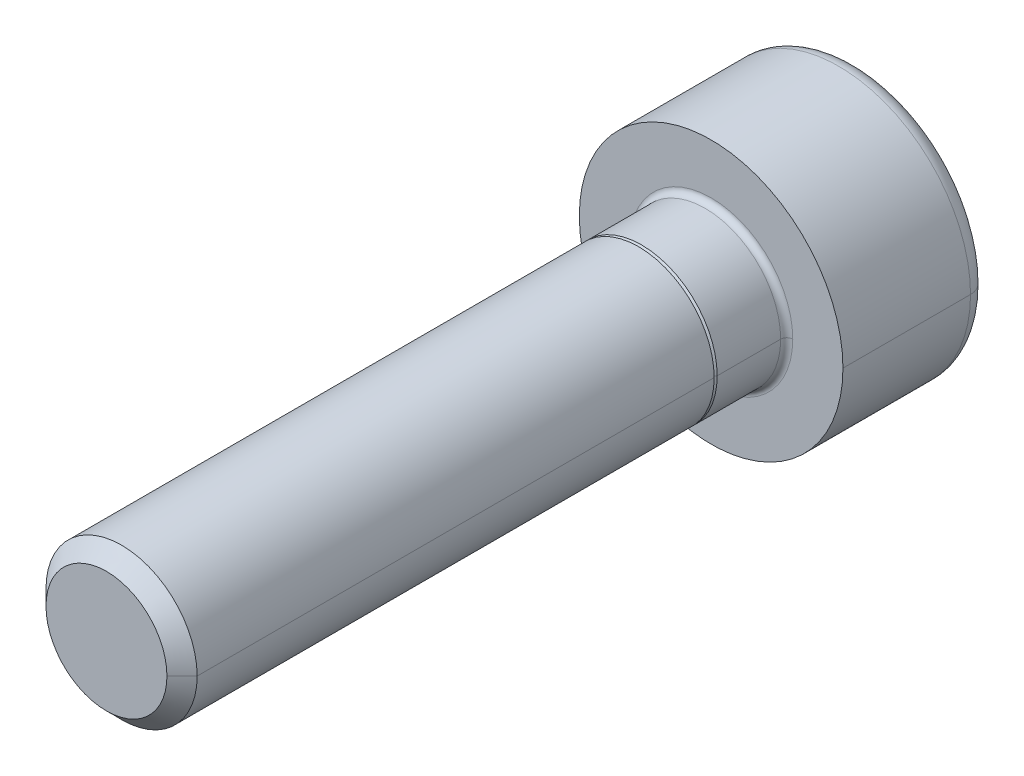
ISO-10303-21;
HEADER;
FILE_DESCRIPTION(('STEP AP214'),'2;1');
FILE_NAME('part.step','',(''),(''),'','','');
FILE_SCHEMA(('AUTOMOTIVE_DESIGN { 1 0 10303 214 1 1 1 1 }'));
ENDSEC;
DATA;
#1=APPLICATION_CONTEXT('core data for automotive mechanical design processes');
#2=APPLICATION_PROTOCOL_DEFINITION('international standard','automotive_design',2000,#1);
#3=PRODUCT_CONTEXT('',#1,'mechanical');
#4=PRODUCT('Part','Part','',(#3));
#5=PRODUCT_RELATED_PRODUCT_CATEGORY('part','',(#4));
#6=PRODUCT_DEFINITION_FORMATION('','',#4);
#7=PRODUCT_DEFINITION_CONTEXT('part definition',#1,'design');
#8=PRODUCT_DEFINITION('design','',#6,#7);
#9=PRODUCT_DEFINITION_SHAPE('','',#8);
#10=(LENGTH_UNIT() NAMED_UNIT(*) SI_UNIT(.MILLI.,.METRE.));
#11=(NAMED_UNIT(*) PLANE_ANGLE_UNIT() SI_UNIT($,.RADIAN.));
#12=(NAMED_UNIT(*) SI_UNIT($,.STERADIAN.) SOLID_ANGLE_UNIT());
#13=UNCERTAINTY_MEASURE_WITH_UNIT(LENGTH_MEASURE(1.E-05),#10,'distance_accuracy_value','');
#14=(GEOMETRIC_REPRESENTATION_CONTEXT(3) GLOBAL_UNCERTAINTY_ASSIGNED_CONTEXT((#13)) GLOBAL_UNIT_ASSIGNED_CONTEXT((#10,
#11,#12)) REPRESENTATION_CONTEXT('',''));
#15=CARTESIAN_POINT('',(0.,0.,0.));
#16=DIRECTION('',(0.,0.,1.));
#17=DIRECTION('',(1.,0.,0.));
#18=AXIS2_PLACEMENT_3D('',#15,#16,#17);
#19=CARTESIAN_POINT('',(0.,0.,-4.22));
#20=DIRECTION('',(0.,0.,1.));
#21=DIRECTION('',(1.,0.,0.));
#22=AXIS2_PLACEMENT_3D('',#19,#20,#21);
#23=TOROIDAL_SURFACE('',#22,3.76,0.6);
#24=CARTESIAN_POINT('',(-3.76,0.,-4.22));
#25=DIRECTION('',(0.,1.,0.));
#26=DIRECTION('',(-1.,0.,0.));
#27=AXIS2_PLACEMENT_3D('',#24,#25,#26);
#28=CIRCLE('',#27,0.6);
#29=CARTESIAN_POINT('',(-3.76,0.,-4.82));
#30=VERTEX_POINT('',#29);
#31=CARTESIAN_POINT('',(-4.36,0.,-4.22));
#32=VERTEX_POINT('',#31);
#33=EDGE_CURVE('E377',#30,#32,#28,.T.);
#34=ORIENTED_EDGE('',*,*,#33,.F.);
#35=CARTESIAN_POINT('',(0.,0.,-4.82));
#36=DIRECTION('',(0.,0.,-1.));
#37=DIRECTION('',(1.,0.,0.));
#38=AXIS2_PLACEMENT_3D('',#35,#36,#37);
#39=CIRCLE('',#38,3.76);
#40=CARTESIAN_POINT('',(3.76,0.,-4.82));
#41=VERTEX_POINT('',#40);
#42=EDGE_CURVE('E274',#41,#30,#39,.T.);
#43=ORIENTED_EDGE('',*,*,#42,.F.);
#44=CARTESIAN_POINT('',(3.76,0.,-4.22));
#45=DIRECTION('',(0.,-1.,0.));
#46=DIRECTION('',(0.,0.,-1.));
#47=AXIS2_PLACEMENT_3D('',#44,#45,#46);
#48=CIRCLE('',#47,0.6);
#49=CARTESIAN_POINT('',(4.36,0.,-4.22));
#50=VERTEX_POINT('',#49);
#51=EDGE_CURVE('E390',#41,#50,#48,.T.);
#52=ORIENTED_EDGE('',*,*,#51,.T.);
#53=CARTESIAN_POINT('',(0.,0.,-4.22));
#54=DIRECTION('',(0.,0.,1.));
#55=DIRECTION('',(1.,0.,0.));
#56=AXIS2_PLACEMENT_3D('',#53,#54,#55);
#57=CIRCLE('',#56,4.36);
#58=EDGE_CURVE('E268',#32,#50,#57,.T.);
#59=ORIENTED_EDGE('',*,*,#58,.F.);
#60=EDGE_LOOP('',(#34,#43,#52,#59));
#61=FACE_BOUND('',#60,.T.);
#62=ADVANCED_FACE('F17',(#61),#23,.T.);
#63=CARTESIAN_POINT('',(0.,0.,0.2));
#64=DIRECTION('',(0.,0.,1.));
#65=DIRECTION('',(1.,0.,0.));
#66=AXIS2_PLACEMENT_3D('',#63,#64,#65);
#67=TOROIDAL_SURFACE('',#66,2.7,0.2);
#68=CARTESIAN_POINT('',(-2.7,0.,0.2));
#69=DIRECTION('',(0.,1.,0.));
#70=DIRECTION('',(-1.,0.,0.));
#71=AXIS2_PLACEMENT_3D('',#68,#69,#70);
#72=CIRCLE('',#71,0.2);
#73=CARTESIAN_POINT('',(-2.5,0.,0.2));
#74=VERTEX_POINT('',#73);
#75=CARTESIAN_POINT('',(-2.7,0.,0.));
#76=VERTEX_POINT('',#75);
#77=EDGE_CURVE('E196',#74,#76,#72,.T.);
#78=ORIENTED_EDGE('',*,*,#77,.F.);
#79=CARTESIAN_POINT('',(0.,0.,0.2));
#80=DIRECTION('',(0.,0.,1.));
#81=DIRECTION('',(1.,0.,0.));
#82=AXIS2_PLACEMENT_3D('',#79,#80,#81);
#83=CIRCLE('',#82,2.5);
#84=CARTESIAN_POINT('',(2.5,0.,0.2));
#85=VERTEX_POINT('',#84);
#86=EDGE_CURVE('E187',#85,#74,#83,.T.);
#87=ORIENTED_EDGE('',*,*,#86,.F.);
#88=CARTESIAN_POINT('',(2.7,0.,0.2));
#89=DIRECTION('',(0.,-1.,0.));
#90=DIRECTION('',(0.,0.,-1.));
#91=AXIS2_PLACEMENT_3D('',#88,#89,#90);
#92=CIRCLE('',#91,0.2);
#93=CARTESIAN_POINT('',(2.7,0.,0.));
#94=VERTEX_POINT('',#93);
#95=EDGE_CURVE('E184',#85,#94,#92,.T.);
#96=ORIENTED_EDGE('',*,*,#95,.T.);
#97=CARTESIAN_POINT('',(0.,0.,0.));
#98=DIRECTION('',(0.,0.,-1.));
#99=DIRECTION('',(1.,0.,0.));
#100=AXIS2_PLACEMENT_3D('',#97,#98,#99);
#101=CIRCLE('',#100,2.7);
#102=EDGE_CURVE('E170',#76,#94,#101,.T.);
#103=ORIENTED_EDGE('',*,*,#102,.F.);
#104=EDGE_LOOP('',(#78,#87,#96,#103));
#105=FACE_BOUND('',#104,.T.);
#106=ADVANCED_FACE('F185',(#105),#67,.F.);
#107=CARTESIAN_POINT('',(0.,0.,20.));
#108=DIRECTION('',(0.,0.,-1.));
#109=DIRECTION('',(-1.,0.,0.));
#110=AXIS2_PLACEMENT_3D('',#107,#108,#109);
#111=CONICAL_SURFACE('',#110,2.,0.785398163397446);
#112=DIRECTION('',(0.707106781186546,0.,-0.707106781186549));
#113=VECTOR('',#112,1.);
#114=CARTESIAN_POINT('',(2.,0.,20.));
#115=LINE('',#114,#113);
#116=CARTESIAN_POINT('',(2.,0.,20.));
#117=VERTEX_POINT('',#116);
#118=CARTESIAN_POINT('',(2.5,0.,19.5));
#119=VERTEX_POINT('',#118);
#120=EDGE_CURVE('E211',#117,#119,#115,.T.);
#121=ORIENTED_EDGE('',*,*,#120,.F.);
#122=CARTESIAN_POINT('',(0.,0.,20.));
#123=DIRECTION('',(0.,0.,1.));
#124=DIRECTION('',(1.,0.,0.));
#125=AXIS2_PLACEMENT_3D('',#122,#123,#124);
#126=CIRCLE('',#125,2.);
#127=CARTESIAN_POINT('',(-2.,0.,20.));
#128=VERTEX_POINT('',#127);
#129=EDGE_CURVE('E11',#128,#117,#126,.T.);
#130=ORIENTED_EDGE('',*,*,#129,.F.);
#131=DIRECTION('',(-0.707106781186546,0.,-0.707106781186549));
#132=VECTOR('',#131,1.);
#133=CARTESIAN_POINT('',(-2.,0.,20.));
#134=LINE('',#133,#132);
#135=CARTESIAN_POINT('',(-2.5,0.,19.5));
#136=VERTEX_POINT('',#135);
#137=EDGE_CURVE('E225',#128,#136,#134,.T.);
#138=ORIENTED_EDGE('',*,*,#137,.T.);
#139=CARTESIAN_POINT('',(0.,0.,19.5));
#140=DIRECTION('',(0.,0.,-1.));
#141=DIRECTION('',(1.,0.,0.));
#142=AXIS2_PLACEMENT_3D('',#139,#140,#141);
#143=CIRCLE('',#142,2.5);
#144=EDGE_CURVE('E20',#119,#136,#143,.T.);
#145=ORIENTED_EDGE('',*,*,#144,.F.);
#146=EDGE_LOOP('',(#121,#130,#138,#145));
#147=FACE_BOUND('',#146,.T.);
#148=ADVANCED_FACE('F353',(#147),#111,.T.);
#149=CARTESIAN_POINT('',(0.,0.,2.4));
#150=DIRECTION('',(0.,0.,1.));
#151=DIRECTION('',(1.,0.,0.));
#152=AXIS2_PLACEMENT_3D('',#149,#150,#151);
#153=PLANE('',#152);
#154=CARTESIAN_POINT('',(0.,0.,2.4));
#155=DIRECTION('',(0.,0.,1.));
#156=DIRECTION('',(1.,0.,0.));
#157=AXIS2_PLACEMENT_3D('',#154,#155,#156);
#158=CIRCLE('',#157,2.4);
#159=CARTESIAN_POINT('',(-2.4,0.,2.4));
#160=VERTEX_POINT('',#159);
#161=CARTESIAN_POINT('',(2.4,0.,2.4));
#162=VERTEX_POINT('',#161);
#163=EDGE_CURVE('E332',#160,#162,#158,.T.);
#164=ORIENTED_EDGE('',*,*,#163,.T.);
#165=CARTESIAN_POINT('',(0.,0.,2.4));
#166=DIRECTION('',(0.,0.,1.));
#167=DIRECTION('',(1.,0.,0.));
#168=AXIS2_PLACEMENT_3D('',#165,#166,#167);
#169=CIRCLE('',#168,2.4);
#170=EDGE_CURVE('E212',#162,#160,#169,.T.);
#171=ORIENTED_EDGE('',*,*,#170,.T.);
#172=EDGE_LOOP('',(#164,#171));
#173=FACE_BOUND('',#172,.T.);
#174=CARTESIAN_POINT('',(0.,0.,2.4));
#175=DIRECTION('',(0.,0.,1.));
#176=DIRECTION('',(1.,0.,0.));
#177=AXIS2_PLACEMENT_3D('',#174,#175,#176);
#178=CIRCLE('',#177,2.5);
#179=CARTESIAN_POINT('',(-2.5,0.,2.4));
#180=VERTEX_POINT('',#179);
#181=CARTESIAN_POINT('',(2.5,0.,2.4));
#182=VERTEX_POINT('',#181);
#183=EDGE_CURVE('E26',#180,#182,#178,.T.);
#184=ORIENTED_EDGE('',*,*,#183,.F.);
#185=CARTESIAN_POINT('',(0.,0.,2.4));
#186=DIRECTION('',(0.,0.,1.));
#187=DIRECTION('',(1.,0.,0.));
#188=AXIS2_PLACEMENT_3D('',#185,#186,#187);
#189=CIRCLE('',#188,2.5);
#190=EDGE_CURVE('E230',#182,#180,#189,.T.);
#191=ORIENTED_EDGE('',*,*,#190,.F.);
#192=EDGE_LOOP('',(#184,#191));
#193=FACE_BOUND('',#192,.T.);
#194=ADVANCED_FACE('F360',(#173,#193),#153,.F.);
#195=CARTESIAN_POINT('',(0.,0.,20.));
#196=DIRECTION('',(0.,0.,1.));
#197=DIRECTION('',(1.,0.,0.));
#198=AXIS2_PLACEMENT_3D('',#195,#196,#197);
#199=PLANE('',#198);
#200=ORIENTED_EDGE('',*,*,#129,.T.);
#201=CARTESIAN_POINT('',(0.,0.,20.));
#202=DIRECTION('',(0.,0.,1.));
#203=DIRECTION('',(1.,0.,0.));
#204=AXIS2_PLACEMENT_3D('',#201,#202,#203);
#205=CIRCLE('',#204,2.);
#206=EDGE_CURVE('E193',#117,#128,#205,.T.);
#207=ORIENTED_EDGE('',*,*,#206,.T.);
#208=EDGE_LOOP('',(#200,#207));
#209=FACE_BOUND('',#208,.T.);
#210=ADVANCED_FACE('F358',(#209),#199,.T.);
#211=CARTESIAN_POINT('',(0.,0.,20.));
#212=DIRECTION('',(0.,0.,-1.));
#213=DIRECTION('',(-1.,0.,0.));
#214=AXIS2_PLACEMENT_3D('',#211,#212,#213);
#215=CYLINDRICAL_SURFACE('',#214,2.5);
#216=DIRECTION('',(0.,0.,-1.));
#217=VECTOR('',#216,1.);
#218=CARTESIAN_POINT('',(2.5,0.,20.));
#219=LINE('',#218,#217);
#220=EDGE_CURVE('E226',#119,#182,#219,.T.);
#221=ORIENTED_EDGE('',*,*,#220,.F.);
#222=ORIENTED_EDGE('',*,*,#144,.T.);
#223=DIRECTION('',(0.,0.,-1.));
#224=VECTOR('',#223,1.);
#225=CARTESIAN_POINT('',(-2.5,0.,20.));
#226=LINE('',#225,#224);
#227=EDGE_CURVE('E217',#136,#180,#226,.T.);
#228=ORIENTED_EDGE('',*,*,#227,.T.);
#229=ORIENTED_EDGE('',*,*,#183,.T.);
#230=EDGE_LOOP('',(#221,#222,#228,#229));
#231=FACE_BOUND('',#230,.T.);
#232=ADVANCED_FACE('F344',(#231),#215,.T.);
#233=CARTESIAN_POINT('',(0.,0.,2.4));
#234=DIRECTION('',(0.,0.,-1.));
#235=DIRECTION('',(-1.,0.,0.));
#236=AXIS2_PLACEMENT_3D('',#233,#234,#235);
#237=CONICAL_SURFACE('',#236,2.4,0.785398163397442);
#238=DIRECTION('',(0.707106781186543,0.,-0.707106781186552));
#239=VECTOR('',#238,1.);
#240=CARTESIAN_POINT('',(2.4,0.,2.4));
#241=LINE('',#240,#239);
#242=CARTESIAN_POINT('',(2.5,0.,2.3));
#243=VERTEX_POINT('',#242);
#244=EDGE_CURVE('E216',#162,#243,#241,.T.);
#245=ORIENTED_EDGE('',*,*,#244,.F.);
#246=ORIENTED_EDGE('',*,*,#163,.F.);
#247=DIRECTION('',(-0.707106781186543,0.,-0.707106781186552));
#248=VECTOR('',#247,1.);
#249=CARTESIAN_POINT('',(-2.4,0.,2.4));
#250=LINE('',#249,#248);
#251=CARTESIAN_POINT('',(-2.5,0.,2.3));
#252=VERTEX_POINT('',#251);
#253=EDGE_CURVE('E244',#160,#252,#250,.T.);
#254=ORIENTED_EDGE('',*,*,#253,.T.);
#255=CARTESIAN_POINT('',(0.,0.,2.3));
#256=DIRECTION('',(0.,0.,-1.));
#257=DIRECTION('',(1.,0.,0.));
#258=AXIS2_PLACEMENT_3D('',#255,#256,#257);
#259=CIRCLE('',#258,2.5);
#260=EDGE_CURVE('E330',#243,#252,#259,.T.);
#261=ORIENTED_EDGE('',*,*,#260,.F.);
#262=EDGE_LOOP('',(#245,#246,#254,#261));
#263=FACE_BOUND('',#262,.T.);
#264=ADVANCED_FACE('F367',(#263),#237,.T.);
#265=CARTESIAN_POINT('',(0.,0.,2.4));
#266=DIRECTION('',(0.,0.,-1.));
#267=DIRECTION('',(-1.,0.,0.));
#268=AXIS2_PLACEMENT_3D('',#265,#266,#267);
#269=CYLINDRICAL_SURFACE('',#268,2.5);
#270=DIRECTION('',(0.,0.,-1.));
#271=VECTOR('',#270,1.);
#272=CARTESIAN_POINT('',(2.5,0.,2.4));
#273=LINE('',#272,#271);
#274=EDGE_CURVE('E248',#243,#85,#273,.T.);
#275=ORIENTED_EDGE('',*,*,#274,.F.);
#276=ORIENTED_EDGE('',*,*,#260,.T.);
#277=DIRECTION('',(0.,0.,-1.));
#278=VECTOR('',#277,1.);
#279=CARTESIAN_POINT('',(-2.5,0.,2.4));
#280=LINE('',#279,#278);
#281=EDGE_CURVE('E253',#252,#74,#280,.T.);
#282=ORIENTED_EDGE('',*,*,#281,.T.);
#283=CARTESIAN_POINT('',(0.,0.,0.2));
#284=DIRECTION('',(0.,0.,1.));
#285=DIRECTION('',(1.,0.,0.));
#286=AXIS2_PLACEMENT_3D('',#283,#284,#285);
#287=CIRCLE('',#286,2.5);
#288=EDGE_CURVE('E203',#74,#85,#287,.T.);
#289=ORIENTED_EDGE('',*,*,#288,.T.);
#290=EDGE_LOOP('',(#275,#276,#282,#289));
#291=FACE_BOUND('',#290,.T.);
#292=ADVANCED_FACE('F480',(#291),#269,.T.);
#293=CARTESIAN_POINT('',(0.,0.,-2.32));
#294=DIRECTION('',(0.,0.,-1.));
#295=DIRECTION('',(0.,-1.,0.));
#296=AXIS2_PLACEMENT_3D('',#293,#294,#295);
#297=PLANE('',#296);
#298=DIRECTION('',(-0.5,-0.866025403784439,0.));
#299=VECTOR('',#298,1.);
#300=CARTESIAN_POINT('',(2.64426423288849,0.,-2.32));
#301=LINE('',#300,#299);
#302=CARTESIAN_POINT('',(2.64426423288849,0.,-2.32));
#303=VERTEX_POINT('',#302);
#304=CARTESIAN_POINT('',(1.32213211644424,-2.29,-2.32));
#305=VERTEX_POINT('',#304);
#306=EDGE_CURVE('E233',#303,#305,#301,.T.);
#307=ORIENTED_EDGE('',*,*,#306,.T.);
#308=DIRECTION('',(-1.,0.,0.));
#309=VECTOR('',#308,1.);
#310=CARTESIAN_POINT('',(1.32213211644424,-2.29,-2.32));
#311=LINE('',#310,#309);
#312=CARTESIAN_POINT('',(-1.32213211644424,-2.29,-2.32));
#313=VERTEX_POINT('',#312);
#314=EDGE_CURVE('E40',#305,#313,#311,.T.);
#315=ORIENTED_EDGE('',*,*,#314,.T.);
#316=DIRECTION('',(-0.5,0.866025403784439,0.));
#317=VECTOR('',#316,1.);
#318=CARTESIAN_POINT('',(-1.32213211644424,-2.29,-2.32));
#319=LINE('',#318,#317);
#320=CARTESIAN_POINT('',(-2.64426423288848,0.,-2.32));
#321=VERTEX_POINT('',#320);
#322=EDGE_CURVE('E48',#313,#321,#319,.T.);
#323=ORIENTED_EDGE('',*,*,#322,.T.);
#324=DIRECTION('',(0.5,0.866025403784438,0.));
#325=VECTOR('',#324,1.);
#326=CARTESIAN_POINT('',(-2.64426423288848,0.,-2.32));
#327=LINE('',#326,#325);
#328=CARTESIAN_POINT('',(-1.32213211644424,2.29,-2.32));
#329=VERTEX_POINT('',#328);
#330=EDGE_CURVE('E298',#321,#329,#327,.T.);
#331=ORIENTED_EDGE('',*,*,#330,.T.);
#332=DIRECTION('',(1.,0.,0.));
#333=VECTOR('',#332,1.);
#334=CARTESIAN_POINT('',(-1.32213211644424,2.29,-2.32));
#335=LINE('',#334,#333);
#336=CARTESIAN_POINT('',(1.32213211644425,2.29,-2.32));
#337=VERTEX_POINT('',#336);
#338=EDGE_CURVE('E315',#329,#337,#335,.T.);
#339=ORIENTED_EDGE('',*,*,#338,.T.);
#340=DIRECTION('',(0.5,-0.866025403784439,0.));
#341=VECTOR('',#340,1.);
#342=CARTESIAN_POINT('',(1.32213211644425,2.29,-2.32));
#343=LINE('',#342,#341);
#344=EDGE_CURVE('E311',#337,#303,#343,.T.);
#345=ORIENTED_EDGE('',*,*,#344,.T.);
#346=EDGE_LOOP('',(#307,#315,#323,#331,#339,#345));
#347=FACE_BOUND('',#346,.T.);
#348=ADVANCED_FACE('F411',(#347),#297,.T.);
#349=CARTESIAN_POINT('',(1.32213211644424,-2.29,-2.32));
#350=DIRECTION('',(0.,-1.,0.));
#351=DIRECTION('',(-1.,0.,0.));
#352=AXIS2_PLACEMENT_3D('',#349,#350,#351);
#353=PLANE('',#352);
#354=DIRECTION('',(-1.,0.,0.));
#355=VECTOR('',#354,1.);
#356=CARTESIAN_POINT('',(1.32213211644424,-2.29,-4.82));
#357=LINE('',#356,#355);
#358=CARTESIAN_POINT('',(1.32213211644424,-2.29,-4.82));
#359=VERTEX_POINT('',#358);
#360=CARTESIAN_POINT('',(-1.32213211644424,-2.29,-4.82));
#361=VERTEX_POINT('',#360);
#362=EDGE_CURVE('E283',#359,#361,#357,.T.);
#363=ORIENTED_EDGE('',*,*,#362,.T.);
#364=DIRECTION('',(0.,0.,-1.));
#365=VECTOR('',#364,1.);
#366=CARTESIAN_POINT('',(-1.32213211644424,-2.29,-2.32));
#367=LINE('',#366,#365);
#368=EDGE_CURVE('E323',#313,#361,#367,.T.);
#369=ORIENTED_EDGE('',*,*,#368,.F.);
#370=ORIENTED_EDGE('',*,*,#314,.F.);
#371=DIRECTION('',(0.,0.,-1.));
#372=VECTOR('',#371,1.);
#373=CARTESIAN_POINT('',(1.32213211644424,-2.29,-2.32));
#374=LINE('',#373,#372);
#375=EDGE_CURVE('E180',#305,#359,#374,.T.);
#376=ORIENTED_EDGE('',*,*,#375,.T.);
#377=EDGE_LOOP('',(#363,#369,#370,#376));
#378=FACE_BOUND('',#377,.T.);
#379=ADVANCED_FACE('F424',(#378),#353,.F.);
#380=CARTESIAN_POINT('',(-1.32213211644424,-2.29,-2.32));
#381=DIRECTION('',(-0.866025403784439,-0.5,0.));
#382=DIRECTION('',(-0.5,0.866025403784439,0.));
#383=AXIS2_PLACEMENT_3D('',#380,#381,#382);
#384=PLANE('',#383);
#385=DIRECTION('',(-0.5,0.866025403784439,0.));
#386=VECTOR('',#385,1.);
#387=CARTESIAN_POINT('',(-1.32213211644424,-2.29,-4.82));
#388=LINE('',#387,#386);
#389=CARTESIAN_POINT('',(-2.64426423288848,0.,-4.82));
#390=VERTEX_POINT('',#389);
#391=EDGE_CURVE('E181',#361,#390,#388,.T.);
#392=ORIENTED_EDGE('',*,*,#391,.T.);
#393=DIRECTION('',(0.,0.,-1.));
#394=VECTOR('',#393,1.);
#395=CARTESIAN_POINT('',(-2.64426423288848,0.,-2.32));
#396=LINE('',#395,#394);
#397=EDGE_CURVE('E295',#321,#390,#396,.T.);
#398=ORIENTED_EDGE('',*,*,#397,.F.);
#399=ORIENTED_EDGE('',*,*,#322,.F.);
#400=ORIENTED_EDGE('',*,*,#368,.T.);
#401=EDGE_LOOP('',(#392,#398,#399,#400));
#402=FACE_BOUND('',#401,.T.);
#403=ADVANCED_FACE('F427',(#402),#384,.F.);
#404=CARTESIAN_POINT('',(-2.64426423288848,0.,-2.32));
#405=DIRECTION('',(-0.866025403784438,0.5,0.));
#406=DIRECTION('',(0.,0.,1.));
#407=AXIS2_PLACEMENT_3D('',#404,#405,#406);
#408=PLANE('',#407);
#409=DIRECTION('',(0.5,0.866025403784438,0.));
#410=VECTOR('',#409,1.);
#411=CARTESIAN_POINT('',(-2.64426423288848,0.,-4.82));
#412=LINE('',#411,#410);
#413=CARTESIAN_POINT('',(-1.32213211644424,2.29,-4.82));
#414=VERTEX_POINT('',#413);
#415=EDGE_CURVE('E302',#390,#414,#412,.T.);
#416=ORIENTED_EDGE('',*,*,#415,.T.);
#417=DIRECTION('',(0.,0.,-1.));
#418=VECTOR('',#417,1.);
#419=CARTESIAN_POINT('',(-1.32213211644424,2.29,-2.32));
#420=LINE('',#419,#418);
#421=EDGE_CURVE('E318',#329,#414,#420,.T.);
#422=ORIENTED_EDGE('',*,*,#421,.F.);
#423=ORIENTED_EDGE('',*,*,#330,.F.);
#424=ORIENTED_EDGE('',*,*,#397,.T.);
#425=EDGE_LOOP('',(#416,#422,#423,#424));
#426=FACE_BOUND('',#425,.T.);
#427=ADVANCED_FACE('F432',(#426),#408,.F.);
#428=CARTESIAN_POINT('',(-1.32213211644424,2.29,-2.32));
#429=DIRECTION('',(0.,1.,0.));
#430=DIRECTION('',(1.,0.,0.));
#431=AXIS2_PLACEMENT_3D('',#428,#429,#430);
#432=PLANE('',#431);
#433=DIRECTION('',(1.,0.,0.));
#434=VECTOR('',#433,1.);
#435=CARTESIAN_POINT('',(-1.32213211644424,2.29,-4.82));
#436=LINE('',#435,#434);
#437=CARTESIAN_POINT('',(1.32213211644425,2.29,-4.82));
#438=VERTEX_POINT('',#437);
#439=EDGE_CURVE('E279',#414,#438,#436,.T.);
#440=ORIENTED_EDGE('',*,*,#439,.T.);
#441=DIRECTION('',(0.,0.,-1.));
#442=VECTOR('',#441,1.);
#443=CARTESIAN_POINT('',(1.32213211644425,2.29,-2.32));
#444=LINE('',#443,#442);
#445=EDGE_CURVE('E312',#337,#438,#444,.T.);
#446=ORIENTED_EDGE('',*,*,#445,.F.);
#447=ORIENTED_EDGE('',*,*,#338,.F.);
#448=ORIENTED_EDGE('',*,*,#421,.T.);
#449=EDGE_LOOP('',(#440,#446,#447,#448));
#450=FACE_BOUND('',#449,.T.);
#451=ADVANCED_FACE('F435',(#450),#432,.F.);
#452=CARTESIAN_POINT('',(1.32213211644425,2.29,-2.32));
#453=DIRECTION('',(0.866025403784439,0.5,0.));
#454=DIRECTION('',(0.,0.,-1.));
#455=AXIS2_PLACEMENT_3D('',#452,#453,#454);
#456=PLANE('',#455);
#457=DIRECTION('',(0.5,-0.866025403784439,0.));
#458=VECTOR('',#457,1.);
#459=CARTESIAN_POINT('',(1.32213211644425,2.29,-4.82));
#460=LINE('',#459,#458);
#461=CARTESIAN_POINT('',(2.64426423288849,0.,-4.82));
#462=VERTEX_POINT('',#461);
#463=EDGE_CURVE('E275',#438,#462,#460,.T.);
#464=ORIENTED_EDGE('',*,*,#463,.T.);
#465=DIRECTION('',(0.,0.,-1.));
#466=VECTOR('',#465,1.);
#467=CARTESIAN_POINT('',(2.64426423288849,0.,-2.32));
#468=LINE('',#467,#466);
#469=EDGE_CURVE('E291',#303,#462,#468,.T.);
#470=ORIENTED_EDGE('',*,*,#469,.F.);
#471=ORIENTED_EDGE('',*,*,#344,.F.);
#472=ORIENTED_EDGE('',*,*,#445,.T.);
#473=EDGE_LOOP('',(#464,#470,#471,#472));
#474=FACE_BOUND('',#473,.T.);
#475=ADVANCED_FACE('F417',(#474),#456,.F.);
#476=CARTESIAN_POINT('',(2.64426423288849,0.,-2.32));
#477=DIRECTION('',(0.866025403784439,-0.5,0.));
#478=DIRECTION('',(0.,0.,-1.));
#479=AXIS2_PLACEMENT_3D('',#476,#477,#478);
#480=PLANE('',#479);
#481=DIRECTION('',(-0.5,-0.866025403784439,0.));
#482=VECTOR('',#481,1.);
#483=CARTESIAN_POINT('',(2.64426423288849,0.,-4.82));
#484=LINE('',#483,#482);
#485=EDGE_CURVE('E280',#462,#359,#484,.T.);
#486=ORIENTED_EDGE('',*,*,#485,.T.);
#487=ORIENTED_EDGE('',*,*,#375,.F.);
#488=ORIENTED_EDGE('',*,*,#306,.F.);
#489=ORIENTED_EDGE('',*,*,#469,.T.);
#490=EDGE_LOOP('',(#486,#487,#488,#489));
#491=FACE_BOUND('',#490,.T.);
#492=ADVANCED_FACE('F421',(#491),#480,.F.);
#493=CARTESIAN_POINT('',(0.,0.,0.));
#494=DIRECTION('',(0.,0.,1.));
#495=DIRECTION('',(1.,0.,0.));
#496=AXIS2_PLACEMENT_3D('',#493,#494,#495);
#497=PLANE('',#496);
#498=CARTESIAN_POINT('',(0.,0.,0.));
#499=DIRECTION('',(0.,0.,-1.));
#500=DIRECTION('',(1.,0.,0.));
#501=AXIS2_PLACEMENT_3D('',#498,#499,#500);
#502=CIRCLE('',#501,2.7);
#503=EDGE_CURVE('E175',#94,#76,#502,.T.);
#504=ORIENTED_EDGE('',*,*,#503,.T.);
#505=ORIENTED_EDGE('',*,*,#102,.T.);
#506=EDGE_LOOP('',(#504,#505));
#507=FACE_BOUND('',#506,.T.);
#508=CARTESIAN_POINT('',(0.,0.,0.));
#509=DIRECTION('',(0.,0.,1.));
#510=DIRECTION('',(1.,0.,0.));
#511=AXIS2_PLACEMENT_3D('',#508,#509,#510);
#512=CIRCLE('',#511,4.36);
#513=CARTESIAN_POINT('',(4.36,0.,0.));
#514=VERTEX_POINT('',#513);
#515=CARTESIAN_POINT('',(-4.36,0.,0.));
#516=VERTEX_POINT('',#515);
#517=EDGE_CURVE('E260',#514,#516,#512,.T.);
#518=ORIENTED_EDGE('',*,*,#517,.T.);
#519=CARTESIAN_POINT('',(0.,0.,0.));
#520=DIRECTION('',(0.,0.,1.));
#521=DIRECTION('',(1.,0.,0.));
#522=AXIS2_PLACEMENT_3D('',#519,#520,#521);
#523=CIRCLE('',#522,4.36);
#524=EDGE_CURVE('E271',#516,#514,#523,.T.);
#525=ORIENTED_EDGE('',*,*,#524,.T.);
#526=EDGE_LOOP('',(#518,#525));
#527=FACE_BOUND('',#526,.T.);
#528=ADVANCED_FACE('F172',(#507,#527),#497,.T.);
#529=CARTESIAN_POINT('',(0.,0.,-4.82));
#530=DIRECTION('',(0.,0.,1.));
#531=DIRECTION('',(1.,0.,0.));
#532=AXIS2_PLACEMENT_3D('',#529,#530,#531);
#533=PLANE('',#532);
#534=ORIENTED_EDGE('',*,*,#362,.F.);
#535=ORIENTED_EDGE('',*,*,#485,.F.);
#536=ORIENTED_EDGE('',*,*,#463,.F.);
#537=ORIENTED_EDGE('',*,*,#439,.F.);
#538=ORIENTED_EDGE('',*,*,#415,.F.);
#539=ORIENTED_EDGE('',*,*,#391,.F.);
#540=EDGE_LOOP('',(#534,#535,#536,#537,#538,#539));
#541=FACE_BOUND('',#540,.T.);
#542=ORIENTED_EDGE('',*,*,#42,.T.);
#543=CARTESIAN_POINT('',(0.,0.,-4.82));
#544=DIRECTION('',(0.,0.,-1.));
#545=DIRECTION('',(1.,0.,0.));
#546=AXIS2_PLACEMENT_3D('',#543,#544,#545);
#547=CIRCLE('',#546,3.76);
#548=EDGE_CURVE('E386',#30,#41,#547,.T.);
#549=ORIENTED_EDGE('',*,*,#548,.T.);
#550=EDGE_LOOP('',(#542,#549));
#551=FACE_BOUND('',#550,.T.);
#552=ADVANCED_FACE('F437',(#541,#551),#533,.F.);
#553=CARTESIAN_POINT('',(0.,0.,-4.82));
#554=DIRECTION('',(0.,0.,1.));
#555=DIRECTION('',(1.,0.,0.));
#556=AXIS2_PLACEMENT_3D('',#553,#554,#555);
#557=CYLINDRICAL_SURFACE('',#556,4.36);
#558=DIRECTION('',(0.,0.,1.));
#559=VECTOR('',#558,1.);
#560=CARTESIAN_POINT('',(-4.36,0.,-4.82));
#561=LINE('',#560,#559);
#562=EDGE_CURVE('E256',#32,#516,#561,.T.);
#563=ORIENTED_EDGE('',*,*,#562,.F.);
#564=ORIENTED_EDGE('',*,*,#58,.T.);
#565=DIRECTION('',(0.,0.,1.));
#566=VECTOR('',#565,1.);
#567=CARTESIAN_POINT('',(4.36,0.,-4.82));
#568=LINE('',#567,#566);
#569=EDGE_CURVE('E264',#50,#514,#568,.T.);
#570=ORIENTED_EDGE('',*,*,#569,.T.);
#571=ORIENTED_EDGE('',*,*,#524,.F.);
#572=EDGE_LOOP('',(#563,#564,#570,#571));
#573=FACE_BOUND('',#572,.T.);
#574=ADVANCED_FACE('F439',(#573),#557,.T.);
#575=CARTESIAN_POINT('',(0.,0.,-4.82));
#576=DIRECTION('',(0.,0.,1.));
#577=DIRECTION('',(1.,0.,0.));
#578=AXIS2_PLACEMENT_3D('',#575,#576,#577);
#579=CYLINDRICAL_SURFACE('',#578,4.36);
#580=CARTESIAN_POINT('',(0.,0.,-4.22));
#581=DIRECTION('',(0.,0.,1.));
#582=DIRECTION('',(1.,0.,0.));
#583=AXIS2_PLACEMENT_3D('',#580,#581,#582);
#584=CIRCLE('',#583,4.36);
#585=EDGE_CURVE('E385',#50,#32,#584,.T.);
#586=ORIENTED_EDGE('',*,*,#585,.T.);
#587=ORIENTED_EDGE('',*,*,#562,.T.);
#588=ORIENTED_EDGE('',*,*,#517,.F.);
#589=ORIENTED_EDGE('',*,*,#569,.F.);
#590=EDGE_LOOP('',(#586,#587,#588,#589));
#591=FACE_BOUND('',#590,.T.);
#592=ADVANCED_FACE('F445',(#591),#579,.T.);
#593=CARTESIAN_POINT('',(0.,0.,2.4));
#594=DIRECTION('',(0.,0.,-1.));
#595=DIRECTION('',(-1.,0.,0.));
#596=AXIS2_PLACEMENT_3D('',#593,#594,#595);
#597=CYLINDRICAL_SURFACE('',#596,2.5);
#598=CARTESIAN_POINT('',(0.,0.,2.3));
#599=DIRECTION('',(0.,0.,-1.));
#600=DIRECTION('',(1.,0.,0.));
#601=AXIS2_PLACEMENT_3D('',#598,#599,#600);
#602=CIRCLE('',#601,2.5);
#603=EDGE_CURVE('E240',#252,#243,#602,.T.);
#604=ORIENTED_EDGE('',*,*,#603,.T.);
#605=ORIENTED_EDGE('',*,*,#274,.T.);
#606=ORIENTED_EDGE('',*,*,#86,.T.);
#607=ORIENTED_EDGE('',*,*,#281,.F.);
#608=EDGE_LOOP('',(#604,#605,#606,#607));
#609=FACE_BOUND('',#608,.T.);
#610=ADVANCED_FACE('F459',(#609),#597,.T.);
#611=CARTESIAN_POINT('',(0.,0.,2.4));
#612=DIRECTION('',(0.,0.,-1.));
#613=DIRECTION('',(-1.,0.,0.));
#614=AXIS2_PLACEMENT_3D('',#611,#612,#613);
#615=CONICAL_SURFACE('',#614,2.4,0.785398163397442);
#616=ORIENTED_EDGE('',*,*,#170,.F.);
#617=ORIENTED_EDGE('',*,*,#244,.T.);
#618=ORIENTED_EDGE('',*,*,#603,.F.);
#619=ORIENTED_EDGE('',*,*,#253,.F.);
#620=EDGE_LOOP('',(#616,#617,#618,#619));
#621=FACE_BOUND('',#620,.T.);
#622=ADVANCED_FACE('F457',(#621),#615,.T.);
#623=CARTESIAN_POINT('',(0.,0.,20.));
#624=DIRECTION('',(0.,0.,-1.));
#625=DIRECTION('',(-1.,0.,0.));
#626=AXIS2_PLACEMENT_3D('',#623,#624,#625);
#627=CYLINDRICAL_SURFACE('',#626,2.5);
#628=CARTESIAN_POINT('',(0.,0.,19.5));
#629=DIRECTION('',(0.,0.,-1.));
#630=DIRECTION('',(1.,0.,0.));
#631=AXIS2_PLACEMENT_3D('',#628,#629,#630);
#632=CIRCLE('',#631,2.5);
#633=EDGE_CURVE('E221',#136,#119,#632,.T.);
#634=ORIENTED_EDGE('',*,*,#633,.T.);
#635=ORIENTED_EDGE('',*,*,#220,.T.);
#636=ORIENTED_EDGE('',*,*,#190,.T.);
#637=ORIENTED_EDGE('',*,*,#227,.F.);
#638=EDGE_LOOP('',(#634,#635,#636,#637));
#639=FACE_BOUND('',#638,.T.);
#640=ADVANCED_FACE('F349',(#639),#627,.T.);
#641=CARTESIAN_POINT('',(0.,0.,20.));
#642=DIRECTION('',(0.,0.,-1.));
#643=DIRECTION('',(-1.,0.,0.));
#644=AXIS2_PLACEMENT_3D('',#641,#642,#643);
#645=CONICAL_SURFACE('',#644,2.,0.785398163397446);
#646=ORIENTED_EDGE('',*,*,#206,.F.);
#647=ORIENTED_EDGE('',*,*,#120,.T.);
#648=ORIENTED_EDGE('',*,*,#633,.F.);
#649=ORIENTED_EDGE('',*,*,#137,.F.);
#650=EDGE_LOOP('',(#646,#647,#648,#649));
#651=FACE_BOUND('',#650,.T.);
#652=ADVANCED_FACE('F356',(#651),#645,.T.);
#653=CARTESIAN_POINT('',(0.,0.,0.2));
#654=DIRECTION('',(0.,0.,1.));
#655=DIRECTION('',(1.,0.,0.));
#656=AXIS2_PLACEMENT_3D('',#653,#654,#655);
#657=TOROIDAL_SURFACE('',#656,2.7,0.2);
#658=ORIENTED_EDGE('',*,*,#288,.F.);
#659=ORIENTED_EDGE('',*,*,#77,.T.);
#660=ORIENTED_EDGE('',*,*,#503,.F.);
#661=ORIENTED_EDGE('',*,*,#95,.F.);
#662=EDGE_LOOP('',(#658,#659,#660,#661));
#663=FACE_BOUND('',#662,.T.);
#664=ADVANCED_FACE('F195',(#663),#657,.F.);
#665=CARTESIAN_POINT('',(0.,0.,-4.22));
#666=DIRECTION('',(0.,0.,1.));
#667=DIRECTION('',(1.,0.,0.));
#668=AXIS2_PLACEMENT_3D('',#665,#666,#667);
#669=TOROIDAL_SURFACE('',#668,3.76,0.6);
#670=ORIENTED_EDGE('',*,*,#548,.F.);
#671=ORIENTED_EDGE('',*,*,#33,.T.);
#672=ORIENTED_EDGE('',*,*,#585,.F.);
#673=ORIENTED_EDGE('',*,*,#51,.F.);
#674=EDGE_LOOP('',(#670,#671,#672,#673));
#675=FACE_BOUND('',#674,.T.);
#676=ADVANCED_FACE('F389',(#675),#669,.T.);
#677=CLOSED_SHELL('',(#62,#106,#148,#194,#210,#232,#264,#292,#348,#379,#403,#427,#451,#475,#492,
#528,#552,#574,#592,#610,#622,#640,#652,#664,#676));
#678=MANIFOLD_SOLID_BREP('B1',#677);
#679=ADVANCED_BREP_SHAPE_REPRESENTATION('',(#18,#678),#14);
#680=SHAPE_DEFINITION_REPRESENTATION(#9,#679);
ENDSEC;
END-ISO-10303-21;
